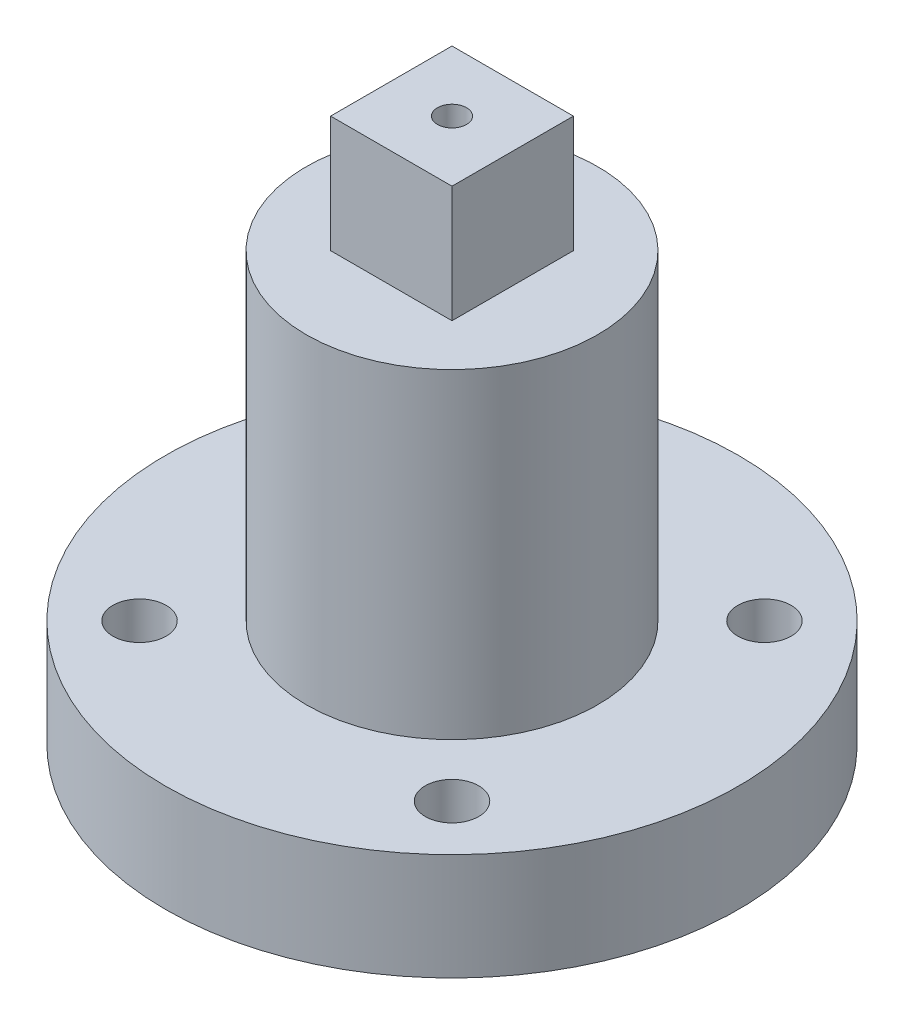
ISO-10303-21;
HEADER;
FILE_DESCRIPTION(('STEP AP214'),'2;1');
FILE_NAME('part.step','',(''),(''),'','','');
FILE_SCHEMA(('AUTOMOTIVE_DESIGN { 1 0 10303 214 1 1 1 1 }'));
ENDSEC;
DATA;
#1=APPLICATION_CONTEXT('core data for automotive mechanical design processes');
#2=APPLICATION_PROTOCOL_DEFINITION('international standard','automotive_design',2000,#1);
#3=PRODUCT_CONTEXT('',#1,'mechanical');
#4=PRODUCT('Part','Part','',(#3));
#5=PRODUCT_RELATED_PRODUCT_CATEGORY('part','',(#4));
#6=PRODUCT_DEFINITION_FORMATION('','',#4);
#7=PRODUCT_DEFINITION_CONTEXT('part definition',#1,'design');
#8=PRODUCT_DEFINITION('design','',#6,#7);
#9=PRODUCT_DEFINITION_SHAPE('','',#8);
#10=(LENGTH_UNIT() NAMED_UNIT(*) SI_UNIT(.MILLI.,.METRE.));
#11=(NAMED_UNIT(*) PLANE_ANGLE_UNIT() SI_UNIT($,.RADIAN.));
#12=(NAMED_UNIT(*) SI_UNIT($,.STERADIAN.) SOLID_ANGLE_UNIT());
#13=UNCERTAINTY_MEASURE_WITH_UNIT(LENGTH_MEASURE(1.E-05),#10,'distance_accuracy_value','');
#14=(GEOMETRIC_REPRESENTATION_CONTEXT(3) GLOBAL_UNCERTAINTY_ASSIGNED_CONTEXT((#13)) GLOBAL_UNIT_ASSIGNED_CONTEXT((#10,
#11,#12)) REPRESENTATION_CONTEXT('',''));
#15=CARTESIAN_POINT('',(0.,0.,0.));
#16=DIRECTION('',(0.,0.,1.));
#17=DIRECTION('',(1.,0.,0.));
#18=AXIS2_PLACEMENT_3D('',#15,#16,#17);
#19=CARTESIAN_POINT('',(0.,11.,0.));
#20=DIRECTION('',(0.,-1.,0.));
#21=DIRECTION('',(0.,0.,-1.));
#22=AXIS2_PLACEMENT_3D('',#19,#20,#21);
#23=CYLINDRICAL_SURFACE('',#22,29.5);
#24=CARTESIAN_POINT('',(0.,11.,0.));
#25=DIRECTION('',(0.,1.,0.));
#26=DIRECTION('',(0.,0.,1.));
#27=AXIS2_PLACEMENT_3D('',#24,#25,#26);
#28=CIRCLE('',#27,29.5);
#29=CARTESIAN_POINT('',(0.,11.,29.5));
#30=VERTEX_POINT('',#29);
#31=EDGE_CURVE('E41',#30,#30,#28,.T.);
#32=ORIENTED_EDGE('',*,*,#31,.F.);
#33=EDGE_LOOP('',(#32));
#34=FACE_BOUND('',#33,.T.);
#35=CARTESIAN_POINT('',(0.,0.,0.));
#36=DIRECTION('',(0.,1.,0.));
#37=DIRECTION('',(0.,0.,1.));
#38=AXIS2_PLACEMENT_3D('',#35,#36,#37);
#39=CIRCLE('',#38,29.5);
#40=CARTESIAN_POINT('',(0.,0.,29.5));
#41=VERTEX_POINT('',#40);
#42=EDGE_CURVE('E98',#41,#41,#39,.T.);
#43=ORIENTED_EDGE('',*,*,#42,.T.);
#44=EDGE_LOOP('',(#43));
#45=FACE_BOUND('',#44,.T.);
#46=ADVANCED_FACE('F33',(#34,#45),#23,.T.);
#47=CARTESIAN_POINT('',(0.,11.,0.));
#48=DIRECTION('',(0.,1.,0.));
#49=DIRECTION('',(0.,0.,1.));
#50=AXIS2_PLACEMENT_3D('',#47,#48,#49);
#51=PLANE('',#50);
#52=CARTESIAN_POINT('',(16.0866792719939,11.,16.086679271994));
#53=DIRECTION('',(0.,1.,0.));
#54=DIRECTION('',(-1.,0.,0.));
#55=AXIS2_PLACEMENT_3D('',#52,#53,#54);
#56=CIRCLE('',#55,2.75);
#57=CARTESIAN_POINT('',(13.3366792719939,11.,16.086679271994));
#58=VERTEX_POINT('',#57);
#59=EDGE_CURVE('E293',#58,#58,#56,.T.);
#60=ORIENTED_EDGE('',*,*,#59,.F.);
#61=EDGE_LOOP('',(#60));
#62=FACE_BOUND('',#61,.T.);
#63=CARTESIAN_POINT('',(-16.086679271994,11.,16.086679271994));
#64=DIRECTION('',(0.,1.,0.));
#65=DIRECTION('',(0.,0.,-1.));
#66=AXIS2_PLACEMENT_3D('',#63,#64,#65);
#67=CIRCLE('',#66,2.75);
#68=CARTESIAN_POINT('',(-16.086679271994,11.,13.336679271994));
#69=VERTEX_POINT('',#68);
#70=EDGE_CURVE('E285',#69,#69,#67,.T.);
#71=ORIENTED_EDGE('',*,*,#70,.F.);
#72=EDGE_LOOP('',(#71));
#73=FACE_BOUND('',#72,.T.);
#74=CARTESIAN_POINT('',(-16.0866792719938,11.,-16.0866792719941));
#75=DIRECTION('',(0.,1.,0.));
#76=DIRECTION('',(1.,0.,0.));
#77=AXIS2_PLACEMENT_3D('',#74,#75,#76);
#78=CIRCLE('',#77,2.75);
#79=CARTESIAN_POINT('',(-13.3366792719938,11.,-16.0866792719941));
#80=VERTEX_POINT('',#79);
#81=EDGE_CURVE('E286',#80,#80,#78,.T.);
#82=ORIENTED_EDGE('',*,*,#81,.F.);
#83=EDGE_LOOP('',(#82));
#84=FACE_BOUND('',#83,.T.);
#85=CARTESIAN_POINT('',(16.086679271994,11.,-16.086679271994));
#86=DIRECTION('',(0.,1.,0.));
#87=DIRECTION('',(0.,0.,1.));
#88=AXIS2_PLACEMENT_3D('',#85,#86,#87);
#89=CIRCLE('',#88,2.75);
#90=CARTESIAN_POINT('',(16.086679271994,11.,-13.336679271994));
#91=VERTEX_POINT('',#90);
#92=EDGE_CURVE('E278',#91,#91,#89,.T.);
#93=ORIENTED_EDGE('',*,*,#92,.F.);
#94=EDGE_LOOP('',(#93));
#95=FACE_BOUND('',#94,.T.);
#96=CARTESIAN_POINT('',(0.,11.,0.));
#97=DIRECTION('',(0.,1.,0.));
#98=DIRECTION('',(0.,0.,1.));
#99=AXIS2_PLACEMENT_3D('',#96,#97,#98);
#100=CIRCLE('',#99,15.);
#101=CARTESIAN_POINT('',(0.,11.,15.));
#102=VERTEX_POINT('',#101);
#103=EDGE_CURVE('E11',#102,#102,#100,.T.);
#104=ORIENTED_EDGE('',*,*,#103,.F.);
#105=EDGE_LOOP('',(#104));
#106=FACE_BOUND('',#105,.T.);
#107=ORIENTED_EDGE('',*,*,#31,.T.);
#108=EDGE_LOOP('',(#107));
#109=FACE_BOUND('',#108,.T.);
#110=ADVANCED_FACE('F112',(#62,#73,#84,#95,#106,#109),#51,.T.);
#111=CARTESIAN_POINT('',(0.,0.,0.));
#112=DIRECTION('',(0.,1.,0.));
#113=DIRECTION('',(0.,0.,1.));
#114=AXIS2_PLACEMENT_3D('',#111,#112,#113);
#115=PLANE('',#114);
#116=CARTESIAN_POINT('',(16.0866792719939,0.,16.086679271994));
#117=DIRECTION('',(0.,1.,0.));
#118=DIRECTION('',(-1.,0.,0.));
#119=AXIS2_PLACEMENT_3D('',#116,#117,#118);
#120=CIRCLE('',#119,2.75);
#121=CARTESIAN_POINT('',(13.3366792719939,0.,16.086679271994));
#122=VERTEX_POINT('',#121);
#123=EDGE_CURVE('E281',#122,#122,#120,.T.);
#124=ORIENTED_EDGE('',*,*,#123,.T.);
#125=EDGE_LOOP('',(#124));
#126=FACE_BOUND('',#125,.T.);
#127=CARTESIAN_POINT('',(-16.086679271994,0.,16.086679271994));
#128=DIRECTION('',(0.,1.,0.));
#129=DIRECTION('',(0.,0.,-1.));
#130=AXIS2_PLACEMENT_3D('',#127,#128,#129);
#131=CIRCLE('',#130,2.75);
#132=CARTESIAN_POINT('',(-16.086679271994,0.,13.336679271994));
#133=VERTEX_POINT('',#132);
#134=EDGE_CURVE('E290',#133,#133,#131,.T.);
#135=ORIENTED_EDGE('',*,*,#134,.T.);
#136=EDGE_LOOP('',(#135));
#137=FACE_BOUND('',#136,.T.);
#138=CARTESIAN_POINT('',(-16.0866792719938,0.,-16.0866792719941));
#139=DIRECTION('',(0.,1.,0.));
#140=DIRECTION('',(1.,0.,0.));
#141=AXIS2_PLACEMENT_3D('',#138,#139,#140);
#142=CIRCLE('',#141,2.75);
#143=CARTESIAN_POINT('',(-13.3366792719938,0.,-16.0866792719941));
#144=VERTEX_POINT('',#143);
#145=EDGE_CURVE('E282',#144,#144,#142,.T.);
#146=ORIENTED_EDGE('',*,*,#145,.T.);
#147=EDGE_LOOP('',(#146));
#148=FACE_BOUND('',#147,.T.);
#149=CARTESIAN_POINT('',(16.086679271994,0.,-16.086679271994));
#150=DIRECTION('',(0.,1.,0.));
#151=DIRECTION('',(0.,0.,1.));
#152=AXIS2_PLACEMENT_3D('',#149,#150,#151);
#153=CIRCLE('',#152,2.75);
#154=CARTESIAN_POINT('',(16.086679271994,0.,-13.336679271994));
#155=VERTEX_POINT('',#154);
#156=EDGE_CURVE('E36',#155,#155,#153,.T.);
#157=ORIENTED_EDGE('',*,*,#156,.T.);
#158=EDGE_LOOP('',(#157));
#159=FACE_BOUND('',#158,.T.);
#160=ORIENTED_EDGE('',*,*,#42,.F.);
#161=EDGE_LOOP('',(#160));
#162=FACE_BOUND('',#161,.T.);
#163=ADVANCED_FACE('F109',(#126,#137,#148,#159,#162),#115,.F.);
#164=CARTESIAN_POINT('',(0.,44.,0.));
#165=DIRECTION('',(0.,-1.,0.));
#166=DIRECTION('',(0.,0.,-1.));
#167=AXIS2_PLACEMENT_3D('',#164,#165,#166);
#168=CYLINDRICAL_SURFACE('',#167,15.);
#169=CARTESIAN_POINT('',(0.,44.,0.));
#170=DIRECTION('',(0.,1.,0.));
#171=DIRECTION('',(0.,0.,1.));
#172=AXIS2_PLACEMENT_3D('',#169,#170,#171);
#173=CIRCLE('',#172,15.);
#174=CARTESIAN_POINT('',(0.,44.,15.));
#175=VERTEX_POINT('',#174);
#176=EDGE_CURVE('E95',#175,#175,#173,.T.);
#177=ORIENTED_EDGE('',*,*,#176,.F.);
#178=EDGE_LOOP('',(#177));
#179=FACE_BOUND('',#178,.T.);
#180=ORIENTED_EDGE('',*,*,#103,.T.);
#181=EDGE_LOOP('',(#180));
#182=FACE_BOUND('',#181,.T.);
#183=ADVANCED_FACE('F111',(#179,#182),#168,.T.);
#184=CARTESIAN_POINT('',(0.,44.,0.));
#185=DIRECTION('',(0.,1.,0.));
#186=DIRECTION('',(0.,0.,1.));
#187=AXIS2_PLACEMENT_3D('',#184,#185,#186);
#188=PLANE('',#187);
#189=DIRECTION('',(0.,0.,1.));
#190=VECTOR('',#189,1.);
#191=CARTESIAN_POINT('',(-6.25,44.,-6.25));
#192=LINE('',#191,#190);
#193=CARTESIAN_POINT('',(-6.25,44.,-6.25));
#194=VERTEX_POINT('',#193);
#195=CARTESIAN_POINT('',(-6.25,44.,6.25));
#196=VERTEX_POINT('',#195);
#197=EDGE_CURVE('E49',#194,#196,#192,.T.);
#198=ORIENTED_EDGE('',*,*,#197,.F.);
#199=DIRECTION('',(-1.,0.,0.));
#200=VECTOR('',#199,1.);
#201=CARTESIAN_POINT('',(6.25,44.,-6.25));
#202=LINE('',#201,#200);
#203=CARTESIAN_POINT('',(6.25,44.,-6.25));
#204=VERTEX_POINT('',#203);
#205=EDGE_CURVE('E53',#204,#194,#202,.T.);
#206=ORIENTED_EDGE('',*,*,#205,.F.);
#207=DIRECTION('',(0.,0.,-1.));
#208=VECTOR('',#207,1.);
#209=CARTESIAN_POINT('',(6.25,44.,-6.25));
#210=LINE('',#209,#208);
#211=CARTESIAN_POINT('',(6.25,44.,6.25));
#212=VERTEX_POINT('',#211);
#213=EDGE_CURVE('E266',#212,#204,#210,.T.);
#214=ORIENTED_EDGE('',*,*,#213,.F.);
#215=DIRECTION('',(1.,0.,0.));
#216=VECTOR('',#215,1.);
#217=CARTESIAN_POINT('',(6.25,44.,6.25));
#218=LINE('',#217,#216);
#219=EDGE_CURVE('E268',#196,#212,#218,.T.);
#220=ORIENTED_EDGE('',*,*,#219,.F.);
#221=EDGE_LOOP('',(#198,#206,#214,#220));
#222=FACE_BOUND('',#221,.T.);
#223=ORIENTED_EDGE('',*,*,#176,.T.);
#224=EDGE_LOOP('',(#223));
#225=FACE_BOUND('',#224,.T.);
#226=ADVANCED_FACE('F118',(#222,#225),#188,.T.);
#227=CARTESIAN_POINT('',(-6.25,56.,-6.25));
#228=DIRECTION('',(1.,0.,0.));
#229=DIRECTION('',(0.,0.,-1.));
#230=AXIS2_PLACEMENT_3D('',#227,#228,#229);
#231=PLANE('',#230);
#232=ORIENTED_EDGE('',*,*,#197,.T.);
#233=DIRECTION('',(0.,-1.,0.));
#234=VECTOR('',#233,1.);
#235=CARTESIAN_POINT('',(-6.25,56.,6.25));
#236=LINE('',#235,#234);
#237=CARTESIAN_POINT('',(-6.25,56.,6.25));
#238=VERTEX_POINT('',#237);
#239=EDGE_CURVE('E78',#238,#196,#236,.T.);
#240=ORIENTED_EDGE('',*,*,#239,.F.);
#241=DIRECTION('',(0.,0.,1.));
#242=VECTOR('',#241,1.);
#243=CARTESIAN_POINT('',(-6.25,56.,-6.25));
#244=LINE('',#243,#242);
#245=CARTESIAN_POINT('',(-6.25,56.,-6.25));
#246=VERTEX_POINT('',#245);
#247=EDGE_CURVE('E84',#246,#238,#244,.T.);
#248=ORIENTED_EDGE('',*,*,#247,.F.);
#249=DIRECTION('',(0.,-1.,0.));
#250=VECTOR('',#249,1.);
#251=CARTESIAN_POINT('',(-6.25,56.,-6.25));
#252=LINE('',#251,#250);
#253=EDGE_CURVE('E270',#246,#194,#252,.T.);
#254=ORIENTED_EDGE('',*,*,#253,.T.);
#255=EDGE_LOOP('',(#232,#240,#248,#254));
#256=FACE_BOUND('',#255,.T.);
#257=ADVANCED_FACE('F94',(#256),#231,.F.);
#258=CARTESIAN_POINT('',(6.25,56.,6.25));
#259=DIRECTION('',(0.,0.,-1.));
#260=DIRECTION('',(-1.,0.,0.));
#261=AXIS2_PLACEMENT_3D('',#258,#259,#260);
#262=PLANE('',#261);
#263=ORIENTED_EDGE('',*,*,#219,.T.);
#264=DIRECTION('',(0.,-1.,0.));
#265=VECTOR('',#264,1.);
#266=CARTESIAN_POINT('',(6.25,56.,6.25));
#267=LINE('',#266,#265);
#268=CARTESIAN_POINT('',(6.25,56.,6.25));
#269=VERTEX_POINT('',#268);
#270=EDGE_CURVE('E80',#269,#212,#267,.T.);
#271=ORIENTED_EDGE('',*,*,#270,.F.);
#272=DIRECTION('',(1.,0.,0.));
#273=VECTOR('',#272,1.);
#274=CARTESIAN_POINT('',(6.25,56.,6.25));
#275=LINE('',#274,#273);
#276=EDGE_CURVE('E73',#238,#269,#275,.T.);
#277=ORIENTED_EDGE('',*,*,#276,.F.);
#278=ORIENTED_EDGE('',*,*,#239,.T.);
#279=EDGE_LOOP('',(#263,#271,#277,#278));
#280=FACE_BOUND('',#279,.T.);
#281=ADVANCED_FACE('F76',(#280),#262,.F.);
#282=CARTESIAN_POINT('',(6.25,56.,-6.25));
#283=DIRECTION('',(-1.,0.,0.));
#284=DIRECTION('',(0.,0.,1.));
#285=AXIS2_PLACEMENT_3D('',#282,#283,#284);
#286=PLANE('',#285);
#287=ORIENTED_EDGE('',*,*,#213,.T.);
#288=DIRECTION('',(0.,-1.,0.));
#289=VECTOR('',#288,1.);
#290=CARTESIAN_POINT('',(6.25,56.,-6.25));
#291=LINE('',#290,#289);
#292=CARTESIAN_POINT('',(6.25,56.,-6.25));
#293=VERTEX_POINT('',#292);
#294=EDGE_CURVE('E100',#293,#204,#291,.T.);
#295=ORIENTED_EDGE('',*,*,#294,.F.);
#296=DIRECTION('',(0.,0.,-1.));
#297=VECTOR('',#296,1.);
#298=CARTESIAN_POINT('',(6.25,56.,-6.25));
#299=LINE('',#298,#297);
#300=EDGE_CURVE('E83',#269,#293,#299,.T.);
#301=ORIENTED_EDGE('',*,*,#300,.F.);
#302=ORIENTED_EDGE('',*,*,#270,.T.);
#303=EDGE_LOOP('',(#287,#295,#301,#302));
#304=FACE_BOUND('',#303,.T.);
#305=ADVANCED_FACE('F218',(#304),#286,.F.);
#306=CARTESIAN_POINT('',(6.25,56.,-6.25));
#307=DIRECTION('',(0.,0.,1.));
#308=DIRECTION('',(1.,0.,0.));
#309=AXIS2_PLACEMENT_3D('',#306,#307,#308);
#310=PLANE('',#309);
#311=ORIENTED_EDGE('',*,*,#205,.T.);
#312=ORIENTED_EDGE('',*,*,#253,.F.);
#313=DIRECTION('',(-1.,0.,0.));
#314=VECTOR('',#313,1.);
#315=CARTESIAN_POINT('',(6.25,56.,-6.25));
#316=LINE('',#315,#314);
#317=EDGE_CURVE('E89',#293,#246,#316,.T.);
#318=ORIENTED_EDGE('',*,*,#317,.F.);
#319=ORIENTED_EDGE('',*,*,#294,.T.);
#320=EDGE_LOOP('',(#311,#312,#318,#319));
#321=FACE_BOUND('',#320,.T.);
#322=ADVANCED_FACE('F189',(#321),#310,.F.);
#323=CARTESIAN_POINT('',(0.,56.,0.));
#324=DIRECTION('',(0.,-1.,0.));
#325=DIRECTION('',(0.,0.,-1.));
#326=AXIS2_PLACEMENT_3D('',#323,#324,#325);
#327=PLANE('',#326);
#328=CARTESIAN_POINT('',(0.,56.,0.));
#329=DIRECTION('',(0.,1.,0.));
#330=DIRECTION('',(0.,0.,1.));
#331=AXIS2_PLACEMENT_3D('',#328,#329,#330);
#332=CIRCLE('',#331,1.5);
#333=CARTESIAN_POINT('',(0.,56.,1.5));
#334=VERTEX_POINT('',#333);
#335=EDGE_CURVE('E299',#334,#334,#332,.T.);
#336=ORIENTED_EDGE('',*,*,#335,.F.);
#337=EDGE_LOOP('',(#336));
#338=FACE_BOUND('',#337,.T.);
#339=ORIENTED_EDGE('',*,*,#247,.T.);
#340=ORIENTED_EDGE('',*,*,#276,.T.);
#341=ORIENTED_EDGE('',*,*,#300,.T.);
#342=ORIENTED_EDGE('',*,*,#317,.T.);
#343=EDGE_LOOP('',(#339,#340,#341,#342));
#344=FACE_BOUND('',#343,.T.);
#345=ADVANCED_FACE('F87',(#338,#344),#327,.F.);
#346=CARTESIAN_POINT('',(16.086679271994,-1.,-16.086679271994));
#347=DIRECTION('',(0.,1.,0.));
#348=DIRECTION('',(0.,0.,1.));
#349=AXIS2_PLACEMENT_3D('',#346,#347,#348);
#350=CYLINDRICAL_SURFACE('',#349,2.75);
#351=ORIENTED_EDGE('',*,*,#92,.T.);
#352=EDGE_LOOP('',(#351));
#353=FACE_BOUND('',#352,.T.);
#354=ORIENTED_EDGE('',*,*,#156,.F.);
#355=EDGE_LOOP('',(#354));
#356=FACE_BOUND('',#355,.T.);
#357=ADVANCED_FACE('F142',(#353,#356),#350,.F.);
#358=CARTESIAN_POINT('',(-16.0866792719938,-1.,-16.0866792719941));
#359=DIRECTION('',(0.,1.,0.));
#360=DIRECTION('',(1.,0.,0.));
#361=AXIS2_PLACEMENT_3D('',#358,#359,#360);
#362=CYLINDRICAL_SURFACE('',#361,2.75);
#363=ORIENTED_EDGE('',*,*,#81,.T.);
#364=EDGE_LOOP('',(#363));
#365=FACE_BOUND('',#364,.T.);
#366=ORIENTED_EDGE('',*,*,#145,.F.);
#367=EDGE_LOOP('',(#366));
#368=FACE_BOUND('',#367,.T.);
#369=ADVANCED_FACE('F152',(#365,#368),#362,.F.);
#370=CARTESIAN_POINT('',(-16.086679271994,-1.,16.086679271994));
#371=DIRECTION('',(0.,1.,0.));
#372=DIRECTION('',(0.,0.,-1.));
#373=AXIS2_PLACEMENT_3D('',#370,#371,#372);
#374=CYLINDRICAL_SURFACE('',#373,2.75);
#375=ORIENTED_EDGE('',*,*,#70,.T.);
#376=EDGE_LOOP('',(#375));
#377=FACE_BOUND('',#376,.T.);
#378=ORIENTED_EDGE('',*,*,#134,.F.);
#379=EDGE_LOOP('',(#378));
#380=FACE_BOUND('',#379,.T.);
#381=ADVANCED_FACE('F157',(#377,#380),#374,.F.);
#382=CARTESIAN_POINT('',(16.0866792719939,-1.,16.086679271994));
#383=DIRECTION('',(0.,1.,0.));
#384=DIRECTION('',(-1.,0.,0.));
#385=AXIS2_PLACEMENT_3D('',#382,#383,#384);
#386=CYLINDRICAL_SURFACE('',#385,2.75);
#387=ORIENTED_EDGE('',*,*,#59,.T.);
#388=EDGE_LOOP('',(#387));
#389=FACE_BOUND('',#388,.T.);
#390=ORIENTED_EDGE('',*,*,#123,.F.);
#391=EDGE_LOOP('',(#390));
#392=FACE_BOUND('',#391,.T.);
#393=ADVANCED_FACE('F167',(#389,#392),#386,.F.);
#394=CARTESIAN_POINT('',(0.,46.,0.));
#395=DIRECTION('',(0.,1.,0.));
#396=DIRECTION('',(0.,0.,1.));
#397=AXIS2_PLACEMENT_3D('',#394,#395,#396);
#398=CYLINDRICAL_SURFACE('',#397,1.5);
#399=CARTESIAN_POINT('',(0.,46.,0.));
#400=DIRECTION('',(0.,1.,0.));
#401=DIRECTION('',(0.,0.,1.));
#402=AXIS2_PLACEMENT_3D('',#399,#400,#401);
#403=CIRCLE('',#402,1.5);
#404=CARTESIAN_POINT('',(0.,46.,1.5));
#405=VERTEX_POINT('',#404);
#406=EDGE_CURVE('E289',#405,#405,#403,.T.);
#407=ORIENTED_EDGE('',*,*,#406,.F.);
#408=EDGE_LOOP('',(#407));
#409=FACE_BOUND('',#408,.T.);
#410=ORIENTED_EDGE('',*,*,#335,.T.);
#411=EDGE_LOOP('',(#410));
#412=FACE_BOUND('',#411,.T.);
#413=ADVANCED_FACE('F177',(#409,#412),#398,.F.);
#414=CARTESIAN_POINT('',(0.,46.,0.));
#415=DIRECTION('',(0.,1.,0.));
#416=DIRECTION('',(0.,0.,1.));
#417=AXIS2_PLACEMENT_3D('',#414,#415,#416);
#418=PLANE('',#417);
#419=ORIENTED_EDGE('',*,*,#406,.T.);
#420=EDGE_LOOP('',(#419));
#421=FACE_BOUND('',#420,.T.);
#422=ADVANCED_FACE('F199',(#421),#418,.T.);
#423=CLOSED_SHELL('',(#46,#110,#163,#183,#226,#257,#281,#305,#322,#345,#357,#369,#381,#393,#413,#422));
#424=MANIFOLD_SOLID_BREP('B2',#423);
#425=ADVANCED_BREP_SHAPE_REPRESENTATION('',(#18,#424),#14);
#426=SHAPE_DEFINITION_REPRESENTATION(#9,#425);
ENDSEC;
END-ISO-10303-21;
